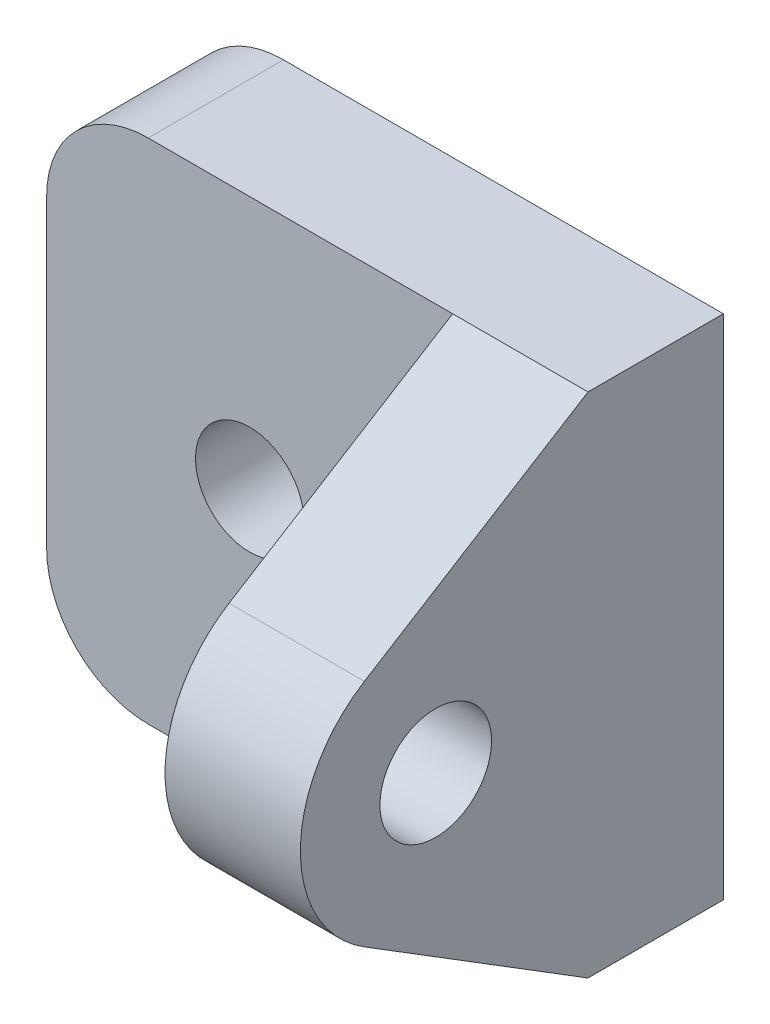
ISO-10303-21;
HEADER;
FILE_DESCRIPTION(('STEP AP214'),'2;1');
FILE_NAME('part.step','',(''),(''),'','','');
FILE_SCHEMA(('AUTOMOTIVE_DESIGN { 1 0 10303 214 1 1 1 1 }'));
ENDSEC;
DATA;
#1=APPLICATION_CONTEXT('core data for automotive mechanical design processes');
#2=APPLICATION_PROTOCOL_DEFINITION('international standard','automotive_design',2000,#1);
#3=PRODUCT_CONTEXT('',#1,'mechanical');
#4=PRODUCT('Part','Part','',(#3));
#5=PRODUCT_RELATED_PRODUCT_CATEGORY('part','',(#4));
#6=PRODUCT_DEFINITION_FORMATION('','',#4);
#7=PRODUCT_DEFINITION_CONTEXT('part definition',#1,'design');
#8=PRODUCT_DEFINITION('design','',#6,#7);
#9=PRODUCT_DEFINITION_SHAPE('','',#8);
#10=(LENGTH_UNIT() NAMED_UNIT(*) SI_UNIT(.MILLI.,.METRE.));
#11=(NAMED_UNIT(*) PLANE_ANGLE_UNIT() SI_UNIT($,.RADIAN.));
#12=(NAMED_UNIT(*) SI_UNIT($,.STERADIAN.) SOLID_ANGLE_UNIT());
#13=UNCERTAINTY_MEASURE_WITH_UNIT(LENGTH_MEASURE(1.E-05),#10,'distance_accuracy_value','');
#14=(GEOMETRIC_REPRESENTATION_CONTEXT(3) GLOBAL_UNCERTAINTY_ASSIGNED_CONTEXT((#13)) GLOBAL_UNIT_ASSIGNED_CONTEXT((#10,
#11,#12)) REPRESENTATION_CONTEXT('',''));
#15=CARTESIAN_POINT('',(0.,0.,0.));
#16=DIRECTION('',(0.,0.,1.));
#17=DIRECTION('',(1.,0.,0.));
#18=AXIS2_PLACEMENT_3D('',#15,#16,#17);
#19=CARTESIAN_POINT('',(-14.,-7.5,4.));
#20=DIRECTION('',(1.,0.,0.));
#21=DIRECTION('',(0.,0.,-1.));
#22=AXIS2_PLACEMENT_3D('',#19,#20,#21);
#23=PLANE('',#22);
#24=DIRECTION('',(0.,-0.527353951722102,0.849645696513013));
#25=VECTOR('',#24,1.);
#26=CARTESIAN_POINT('',(-14.,7.20648963450238,4.47288887873628));
#27=LINE('',#26,#25);
#28=CARTESIAN_POINT('',(-14.,7.5,4.));
#29=VERTEX_POINT('',#28);
#30=CARTESIAN_POINT('',(-14.,3.39769999584322,10.6094158068884));
#31=VERTEX_POINT('',#30);
#32=EDGE_CURVE('E196',#29,#31,#27,.T.);
#33=ORIENTED_EDGE('',*,*,#32,.F.);
#34=DIRECTION('',(0.,-1.,0.));
#35=VECTOR('',#34,1.);
#36=CARTESIAN_POINT('',(-14.,-7.5,4.));
#37=LINE('',#36,#35);
#38=CARTESIAN_POINT('',(-14.,-7.5,4.));
#39=VERTEX_POINT('',#38);
#40=EDGE_CURVE('E122',#29,#39,#37,.T.);
#41=ORIENTED_EDGE('',*,*,#40,.T.);
#42=DIRECTION('',(0.,0.527190067356387,0.849747393571036));
#43=VECTOR('',#42,1.);
#44=CARTESIAN_POINT('',(-14.,-7.20744328921628,4.47155536087164));
#45=LINE('',#44,#43);
#46=CARTESIAN_POINT('',(-14.,-3.39987236449298,10.6087602694255));
#47=VERTEX_POINT('',#46);
#48=EDGE_CURVE('E213',#39,#47,#45,.T.);
#49=ORIENTED_EDGE('',*,*,#48,.T.);
#50=CARTESIAN_POINT('',(-14.,-0.000882790208836116,8.5));
#51=DIRECTION('',(-1.,0.,0.));
#52=DIRECTION('',(0.,0.,1.));
#53=AXIS2_PLACEMENT_3D('',#50,#51,#52);
#54=CIRCLE('',#53,4.);
#55=EDGE_CURVE('E204',#47,#31,#54,.T.);
#56=ORIENTED_EDGE('',*,*,#55,.T.);
#57=EDGE_LOOP('',(#33,#41,#49,#56));
#58=FACE_BOUND('',#57,.T.);
#59=CARTESIAN_POINT('',(-14.,-0.000882790208836116,8.5));
#60=DIRECTION('',(-1.,0.,0.));
#61=DIRECTION('',(0.,0.,1.));
#62=AXIS2_PLACEMENT_3D('',#59,#60,#61);
#63=CIRCLE('',#62,1.65);
#64=CARTESIAN_POINT('',(-14.,-0.000882790208836116,10.15));
#65=VERTEX_POINT('',#64);
#66=EDGE_CURVE('E206',#65,#65,#63,.T.);
#67=ORIENTED_EDGE('',*,*,#66,.F.);
#68=EDGE_LOOP('',(#67));
#69=FACE_BOUND('',#68,.T.);
#70=ADVANCED_FACE('F41',(#58,#69),#23,.F.);
#71=CARTESIAN_POINT('',(14.,-7.5,4.));
#72=DIRECTION('',(0.,1.,0.));
#73=DIRECTION('',(-1.,0.,0.));
#74=AXIS2_PLACEMENT_3D('',#71,#72,#73);
#75=PLANE('',#74);
#76=DIRECTION('',(1.,0.,0.));
#77=VECTOR('',#76,1.);
#78=CARTESIAN_POINT('',(14.,-7.5,0.));
#79=LINE('',#78,#77);
#80=CARTESIAN_POINT('',(-23.,-7.5,0.));
#81=VERTEX_POINT('',#80);
#82=CARTESIAN_POINT('',(-10.,-7.5,0.));
#83=VERTEX_POINT('',#82);
#84=EDGE_CURVE('E140',#81,#83,#79,.T.);
#85=ORIENTED_EDGE('',*,*,#84,.T.);
#86=DIRECTION('',(0.,0.,-1.));
#87=VECTOR('',#86,1.);
#88=CARTESIAN_POINT('',(-10.,-7.5,22.5019251673331));
#89=LINE('',#88,#87);
#90=CARTESIAN_POINT('',(-10.,-7.5,4.));
#91=VERTEX_POINT('',#90);
#92=EDGE_CURVE('E57',#91,#83,#89,.T.);
#93=ORIENTED_EDGE('',*,*,#92,.F.);
#94=DIRECTION('',(1.,0.,0.));
#95=VECTOR('',#94,1.);
#96=CARTESIAN_POINT('',(14.,-7.5,4.));
#97=LINE('',#96,#95);
#98=EDGE_CURVE('E139',#39,#91,#97,.T.);
#99=ORIENTED_EDGE('',*,*,#98,.F.);
#100=DIRECTION('',(-1.,0.,0.));
#101=VECTOR('',#100,1.);
#102=CARTESIAN_POINT('',(-14.,-7.5,4.));
#103=LINE('',#102,#101);
#104=CARTESIAN_POINT('',(-23.,-7.5,4.));
#105=VERTEX_POINT('',#104);
#106=EDGE_CURVE('E180',#39,#105,#103,.T.);
#107=ORIENTED_EDGE('',*,*,#106,.T.);
#108=DIRECTION('',(0.,0.,-1.));
#109=VECTOR('',#108,1.);
#110=CARTESIAN_POINT('',(-23.,-7.5,0.));
#111=LINE('',#110,#109);
#112=EDGE_CURVE('E11',#105,#81,#111,.T.);
#113=ORIENTED_EDGE('',*,*,#112,.T.);
#114=EDGE_LOOP('',(#85,#93,#99,#107,#113));
#115=FACE_BOUND('',#114,.T.);
#116=ADVANCED_FACE('F255',(#115),#75,.F.);
#117=CARTESIAN_POINT('',(14.,7.5,4.));
#118=DIRECTION('',(0.,-1.,0.));
#119=DIRECTION('',(1.,0.,0.));
#120=AXIS2_PLACEMENT_3D('',#117,#118,#119);
#121=PLANE('',#120);
#122=DIRECTION('',(-1.,0.,0.));
#123=VECTOR('',#122,1.);
#124=CARTESIAN_POINT('',(-10.,7.5,4.));
#125=LINE('',#124,#123);
#126=CARTESIAN_POINT('',(-10.,7.5,4.));
#127=VERTEX_POINT('',#126);
#128=EDGE_CURVE('E129',#127,#29,#125,.T.);
#129=ORIENTED_EDGE('',*,*,#128,.F.);
#130=DIRECTION('',(0.,0.,-1.));
#131=VECTOR('',#130,1.);
#132=CARTESIAN_POINT('',(-10.,7.5,22.5019251673331));
#133=LINE('',#132,#131);
#134=CARTESIAN_POINT('',(-10.,7.5,0.));
#135=VERTEX_POINT('',#134);
#136=EDGE_CURVE('E115',#127,#135,#133,.T.);
#137=ORIENTED_EDGE('',*,*,#136,.T.);
#138=DIRECTION('',(-1.,0.,0.));
#139=VECTOR('',#138,1.);
#140=CARTESIAN_POINT('',(14.,7.5,0.));
#141=LINE('',#140,#139);
#142=CARTESIAN_POINT('',(-23.,7.5,0.));
#143=VERTEX_POINT('',#142);
#144=EDGE_CURVE('E126',#135,#143,#141,.T.);
#145=ORIENTED_EDGE('',*,*,#144,.T.);
#146=DIRECTION('',(0.,0.,-1.));
#147=VECTOR('',#146,1.);
#148=CARTESIAN_POINT('',(-23.,7.5,4.));
#149=LINE('',#148,#147);
#150=CARTESIAN_POINT('',(-23.,7.5,4.));
#151=VERTEX_POINT('',#150);
#152=EDGE_CURVE('E160',#143,#151,#149,.F.);
#153=ORIENTED_EDGE('',*,*,#152,.T.);
#154=DIRECTION('',(1.,0.,0.));
#155=VECTOR('',#154,1.);
#156=CARTESIAN_POINT('',(-14.,7.5,4.));
#157=LINE('',#156,#155);
#158=EDGE_CURVE('E172',#151,#29,#157,.T.);
#159=ORIENTED_EDGE('',*,*,#158,.T.);
#160=EDGE_LOOP('',(#129,#137,#145,#153,#159));
#161=FACE_BOUND('',#160,.T.);
#162=ADVANCED_FACE('F125',(#161),#121,.F.);
#163=CARTESIAN_POINT('',(0.,0.,0.));
#164=DIRECTION('',(0.,0.,1.));
#165=DIRECTION('',(1.,0.,0.));
#166=AXIS2_PLACEMENT_3D('',#163,#164,#165);
#167=PLANE('',#166);
#168=ORIENTED_EDGE('',*,*,#144,.F.);
#169=DIRECTION('',(0.,-1.,0.));
#170=VECTOR('',#169,1.);
#171=CARTESIAN_POINT('',(-10.,7.5,0.));
#172=LINE('',#171,#170);
#173=EDGE_CURVE('E111',#135,#83,#172,.T.);
#174=ORIENTED_EDGE('',*,*,#173,.T.);
#175=ORIENTED_EDGE('',*,*,#84,.F.);
#176=CARTESIAN_POINT('',(-23.,-4.5,0.));
#177=DIRECTION('',(0.,0.,1.));
#178=DIRECTION('',(1.,0.,0.));
#179=AXIS2_PLACEMENT_3D('',#176,#177,#178);
#180=CIRCLE('',#179,3.);
#181=CARTESIAN_POINT('',(-26.,-4.5,0.));
#182=VERTEX_POINT('',#181);
#183=EDGE_CURVE('E155',#81,#182,#180,.F.);
#184=ORIENTED_EDGE('',*,*,#183,.T.);
#185=DIRECTION('',(0.,1.,0.));
#186=VECTOR('',#185,1.);
#187=CARTESIAN_POINT('',(-26.,-7.5,0.));
#188=LINE('',#187,#186);
#189=CARTESIAN_POINT('',(-26.,4.5,0.));
#190=VERTEX_POINT('',#189);
#191=EDGE_CURVE('E237',#182,#190,#188,.T.);
#192=ORIENTED_EDGE('',*,*,#191,.T.);
#193=CARTESIAN_POINT('',(-23.,4.5,0.));
#194=DIRECTION('',(0.,0.,1.));
#195=DIRECTION('',(1.,0.,0.));
#196=AXIS2_PLACEMENT_3D('',#193,#194,#195);
#197=CIRCLE('',#196,3.);
#198=EDGE_CURVE('E136',#190,#143,#197,.F.);
#199=ORIENTED_EDGE('',*,*,#198,.T.);
#200=EDGE_LOOP('',(#168,#174,#175,#184,#192,#199));
#201=FACE_BOUND('',#200,.T.);
#202=CARTESIAN_POINT('',(-20.,0.,0.));
#203=DIRECTION('',(0.,0.,-1.));
#204=DIRECTION('',(-1.,0.,0.));
#205=AXIS2_PLACEMENT_3D('',#202,#203,#204);
#206=CIRCLE('',#205,1.6);
#207=CARTESIAN_POINT('',(-21.6,0.,0.));
#208=VERTEX_POINT('',#207);
#209=EDGE_CURVE('E241',#208,#208,#206,.T.);
#210=ORIENTED_EDGE('',*,*,#209,.F.);
#211=EDGE_LOOP('',(#210));
#212=FACE_BOUND('',#211,.T.);
#213=ADVANCED_FACE('F133',(#201,#212),#167,.F.);
#214=CARTESIAN_POINT('',(-10.,-7.20744328921628,4.47155536087164));
#215=DIRECTION('',(0.,-0.849747393571036,0.527190067356387));
#216=DIRECTION('',(0.,-0.527190067356386,-0.849747393571036));
#217=AXIS2_PLACEMENT_3D('',#214,#215,#216);
#218=PLANE('',#217);
#219=ORIENTED_EDGE('',*,*,#48,.F.);
#220=ORIENTED_EDGE('',*,*,#98,.T.);
#221=DIRECTION('',(0.,0.527190067356387,0.849747393571036));
#222=VECTOR('',#221,1.);
#223=CARTESIAN_POINT('',(-10.,-7.20744328921628,4.47155536087164));
#224=LINE('',#223,#222);
#225=CARTESIAN_POINT('',(-10.,-3.39987236449298,10.6087602694255));
#226=VERTEX_POINT('',#225);
#227=EDGE_CURVE('E211',#91,#226,#224,.T.);
#228=ORIENTED_EDGE('',*,*,#227,.T.);
#229=DIRECTION('',(-1.,0.,0.));
#230=VECTOR('',#229,1.);
#231=CARTESIAN_POINT('',(-10.,-3.39987236449298,10.6087602694255));
#232=LINE('',#231,#230);
#233=EDGE_CURVE('E219',#226,#47,#232,.T.);
#234=ORIENTED_EDGE('',*,*,#233,.T.);
#235=EDGE_LOOP('',(#219,#220,#228,#234));
#236=FACE_BOUND('',#235,.T.);
#237=ADVANCED_FACE('F253',(#236),#218,.T.);
#238=CARTESIAN_POINT('',(-10.,7.20648963450238,4.47288887873628));
#239=DIRECTION('',(0.,-0.849645696513013,-0.527353951722102));
#240=DIRECTION('',(0.,0.527353951722102,-0.849645696513013));
#241=AXIS2_PLACEMENT_3D('',#238,#239,#240);
#242=PLANE('',#241);
#243=ORIENTED_EDGE('',*,*,#32,.T.);
#244=DIRECTION('',(-1.,0.,0.));
#245=VECTOR('',#244,1.);
#246=CARTESIAN_POINT('',(-10.,3.39769999584322,10.6094158068884));
#247=LINE('',#246,#245);
#248=CARTESIAN_POINT('',(-10.,3.39769999584322,10.6094158068884));
#249=VERTEX_POINT('',#248);
#250=EDGE_CURVE('E200',#249,#31,#247,.T.);
#251=ORIENTED_EDGE('',*,*,#250,.F.);
#252=DIRECTION('',(0.,-0.527353951722102,0.849645696513013));
#253=VECTOR('',#252,1.);
#254=CARTESIAN_POINT('',(-10.,7.20648963450238,4.47288887873628));
#255=LINE('',#254,#253);
#256=EDGE_CURVE('E198',#127,#249,#255,.T.);
#257=ORIENTED_EDGE('',*,*,#256,.F.);
#258=ORIENTED_EDGE('',*,*,#128,.T.);
#259=EDGE_LOOP('',(#243,#251,#257,#258));
#260=FACE_BOUND('',#259,.T.);
#261=ADVANCED_FACE('F194',(#260),#242,.F.);
#262=CARTESIAN_POINT('',(-10.,-0.000882790208836116,8.5));
#263=DIRECTION('',(-1.,0.,0.));
#264=DIRECTION('',(0.,0.,1.));
#265=AXIS2_PLACEMENT_3D('',#262,#263,#264);
#266=CYLINDRICAL_SURFACE('',#265,4.);
#267=ORIENTED_EDGE('',*,*,#55,.F.);
#268=ORIENTED_EDGE('',*,*,#233,.F.);
#269=CARTESIAN_POINT('',(-10.,-0.000882790208836116,8.5));
#270=DIRECTION('',(-1.,0.,0.));
#271=DIRECTION('',(0.,0.,1.));
#272=AXIS2_PLACEMENT_3D('',#269,#270,#271);
#273=CIRCLE('',#272,4.);
#274=EDGE_CURVE('E230',#226,#249,#273,.T.);
#275=ORIENTED_EDGE('',*,*,#274,.T.);
#276=ORIENTED_EDGE('',*,*,#250,.T.);
#277=EDGE_LOOP('',(#267,#268,#275,#276));
#278=FACE_BOUND('',#277,.T.);
#279=ADVANCED_FACE('F252',(#278),#266,.T.);
#280=CARTESIAN_POINT('',(-10.,-0.000882790208836116,8.5));
#281=DIRECTION('',(-1.,0.,0.));
#282=DIRECTION('',(0.,0.,1.));
#283=AXIS2_PLACEMENT_3D('',#280,#281,#282);
#284=CYLINDRICAL_SURFACE('',#283,1.65);
#285=CARTESIAN_POINT('',(-10.,-0.000882790208836116,8.5));
#286=DIRECTION('',(-1.,0.,0.));
#287=DIRECTION('',(0.,0.,1.));
#288=AXIS2_PLACEMENT_3D('',#285,#286,#287);
#289=CIRCLE('',#288,1.65);
#290=CARTESIAN_POINT('',(-10.,-0.000882790208836116,10.15));
#291=VERTEX_POINT('',#290);
#292=EDGE_CURVE('E221',#291,#291,#289,.T.);
#293=ORIENTED_EDGE('',*,*,#292,.F.);
#294=EDGE_LOOP('',(#293));
#295=FACE_BOUND('',#294,.T.);
#296=ORIENTED_EDGE('',*,*,#66,.T.);
#297=EDGE_LOOP('',(#296));
#298=FACE_BOUND('',#297,.T.);
#299=ADVANCED_FACE('F294',(#295,#298),#284,.F.);
#300=CARTESIAN_POINT('',(-10.,0.,0.));
#301=DIRECTION('',(-1.,0.,0.));
#302=DIRECTION('',(0.,0.,1.));
#303=AXIS2_PLACEMENT_3D('',#300,#301,#302);
#304=PLANE('',#303);
#305=ORIENTED_EDGE('',*,*,#227,.F.);
#306=ORIENTED_EDGE('',*,*,#92,.T.);
#307=ORIENTED_EDGE('',*,*,#173,.F.);
#308=ORIENTED_EDGE('',*,*,#136,.F.);
#309=ORIENTED_EDGE('',*,*,#256,.T.);
#310=ORIENTED_EDGE('',*,*,#274,.F.);
#311=EDGE_LOOP('',(#305,#306,#307,#308,#309,#310));
#312=FACE_BOUND('',#311,.T.);
#313=ORIENTED_EDGE('',*,*,#292,.T.);
#314=EDGE_LOOP('',(#313));
#315=FACE_BOUND('',#314,.T.);
#316=ADVANCED_FACE('F113',(#312,#315),#304,.F.);
#317=CARTESIAN_POINT('',(-26.,-7.5,23.2093727122985));
#318=DIRECTION('',(-1.,0.,0.));
#319=DIRECTION('',(0.,0.,1.));
#320=AXIS2_PLACEMENT_3D('',#317,#318,#319);
#321=PLANE('',#320);
#322=DIRECTION('',(0.,1.,0.));
#323=VECTOR('',#322,1.);
#324=CARTESIAN_POINT('',(-26.,-7.5,4.));
#325=LINE('',#324,#323);
#326=CARTESIAN_POINT('',(-26.,-4.5,4.));
#327=VERTEX_POINT('',#326);
#328=CARTESIAN_POINT('',(-26.,4.5,4.));
#329=VERTEX_POINT('',#328);
#330=EDGE_CURVE('E170',#327,#329,#325,.T.);
#331=ORIENTED_EDGE('',*,*,#330,.T.);
#332=DIRECTION('',(0.,0.,-1.));
#333=VECTOR('',#332,1.);
#334=CARTESIAN_POINT('',(-26.,4.5,0.));
#335=LINE('',#334,#333);
#336=EDGE_CURVE('E151',#329,#190,#335,.T.);
#337=ORIENTED_EDGE('',*,*,#336,.T.);
#338=ORIENTED_EDGE('',*,*,#191,.F.);
#339=DIRECTION('',(0.,0.,-1.));
#340=VECTOR('',#339,1.);
#341=CARTESIAN_POINT('',(-26.,-4.5,4.));
#342=LINE('',#341,#340);
#343=EDGE_CURVE('E145',#182,#327,#342,.F.);
#344=ORIENTED_EDGE('',*,*,#343,.T.);
#345=EDGE_LOOP('',(#331,#337,#338,#344));
#346=FACE_BOUND('',#345,.T.);
#347=ADVANCED_FACE('F176',(#346),#321,.T.);
#348=CARTESIAN_POINT('',(-20.,0.,23.2093727122985));
#349=DIRECTION('',(0.,0.,-1.));
#350=DIRECTION('',(-1.,0.,0.));
#351=AXIS2_PLACEMENT_3D('',#348,#349,#350);
#352=CYLINDRICAL_SURFACE('',#351,1.6);
#353=ORIENTED_EDGE('',*,*,#209,.T.);
#354=EDGE_LOOP('',(#353));
#355=FACE_BOUND('',#354,.T.);
#356=CARTESIAN_POINT('',(-20.,0.,4.));
#357=DIRECTION('',(0.,0.,1.));
#358=DIRECTION('',(1.,0.,0.));
#359=AXIS2_PLACEMENT_3D('',#356,#357,#358);
#360=CIRCLE('',#359,1.6);
#361=CARTESIAN_POINT('',(-18.4,0.,4.));
#362=VERTEX_POINT('',#361);
#363=EDGE_CURVE('E234',#362,#362,#360,.F.);
#364=ORIENTED_EDGE('',*,*,#363,.F.);
#365=EDGE_LOOP('',(#364));
#366=FACE_BOUND('',#365,.T.);
#367=ADVANCED_FACE('F263',(#355,#366),#352,.F.);
#368=CARTESIAN_POINT('',(0.,0.,4.));
#369=DIRECTION('',(0.,0.,1.));
#370=DIRECTION('',(1.,0.,0.));
#371=AXIS2_PLACEMENT_3D('',#368,#369,#370);
#372=PLANE('',#371);
#373=ORIENTED_EDGE('',*,*,#158,.F.);
#374=CARTESIAN_POINT('',(-23.,4.5,4.));
#375=DIRECTION('',(0.,0.,1.));
#376=DIRECTION('',(1.,0.,0.));
#377=AXIS2_PLACEMENT_3D('',#374,#375,#376);
#378=CIRCLE('',#377,3.);
#379=EDGE_CURVE('E50',#151,#329,#378,.T.);
#380=ORIENTED_EDGE('',*,*,#379,.T.);
#381=ORIENTED_EDGE('',*,*,#330,.F.);
#382=CARTESIAN_POINT('',(-23.,-4.5,4.));
#383=DIRECTION('',(0.,0.,1.));
#384=DIRECTION('',(1.,0.,0.));
#385=AXIS2_PLACEMENT_3D('',#382,#383,#384);
#386=CIRCLE('',#385,3.);
#387=EDGE_CURVE('E65',#327,#105,#386,.T.);
#388=ORIENTED_EDGE('',*,*,#387,.T.);
#389=ORIENTED_EDGE('',*,*,#106,.F.);
#390=ORIENTED_EDGE('',*,*,#40,.F.);
#391=EDGE_LOOP('',(#373,#380,#381,#388,#389,#390));
#392=FACE_BOUND('',#391,.T.);
#393=ORIENTED_EDGE('',*,*,#363,.T.);
#394=EDGE_LOOP('',(#393));
#395=FACE_BOUND('',#394,.T.);
#396=ADVANCED_FACE('F168',(#392,#395),#372,.T.);
#397=CARTESIAN_POINT('',(-23.,4.5,23.2093727122985));
#398=DIRECTION('',(0.,0.,1.));
#399=DIRECTION('',(1.,0.,0.));
#400=AXIS2_PLACEMENT_3D('',#397,#398,#399);
#401=CYLINDRICAL_SURFACE('',#400,3.);
#402=ORIENTED_EDGE('',*,*,#379,.F.);
#403=ORIENTED_EDGE('',*,*,#152,.F.);
#404=ORIENTED_EDGE('',*,*,#198,.F.);
#405=ORIENTED_EDGE('',*,*,#336,.F.);
#406=EDGE_LOOP('',(#402,#403,#404,#405));
#407=FACE_BOUND('',#406,.T.);
#408=ADVANCED_FACE('F182',(#407),#401,.T.);
#409=CARTESIAN_POINT('',(-23.,-4.5,4.));
#410=DIRECTION('',(0.,0.,1.));
#411=DIRECTION('',(1.,0.,0.));
#412=AXIS2_PLACEMENT_3D('',#409,#410,#411);
#413=CYLINDRICAL_SURFACE('',#412,3.);
#414=ORIENTED_EDGE('',*,*,#387,.F.);
#415=ORIENTED_EDGE('',*,*,#343,.F.);
#416=ORIENTED_EDGE('',*,*,#183,.F.);
#417=ORIENTED_EDGE('',*,*,#112,.F.);
#418=EDGE_LOOP('',(#414,#415,#416,#417));
#419=FACE_BOUND('',#418,.T.);
#420=ADVANCED_FACE('F43',(#419),#413,.T.);
#421=CLOSED_SHELL('',(#70,#116,#162,#213,#237,#261,#279,#299,#316,#347,#367,#396,#408,#420));
#422=MANIFOLD_SOLID_BREP('B2',#421);
#423=ADVANCED_BREP_SHAPE_REPRESENTATION('',(#18,#422),#14);
#424=SHAPE_DEFINITION_REPRESENTATION(#9,#423);
ENDSEC;
END-ISO-10303-21;
